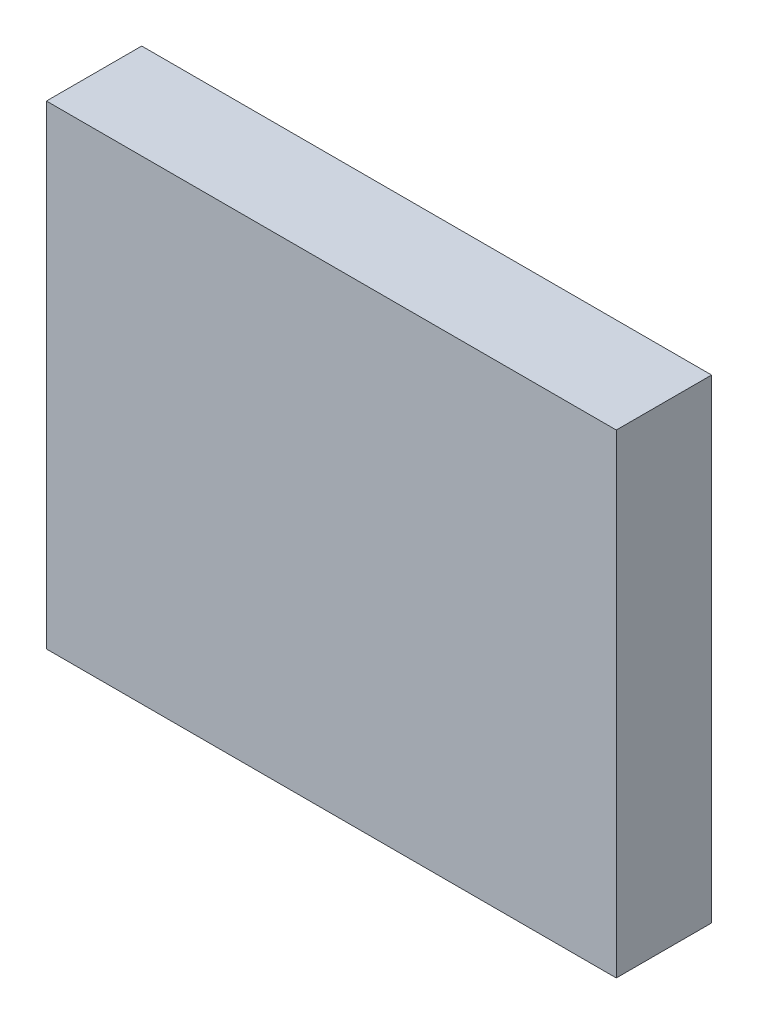
ISO-10303-21;
HEADER;
FILE_DESCRIPTION(('STEP AP214'),'2;1');
FILE_NAME('part.step','',(''),(''),'','','');
FILE_SCHEMA(('AUTOMOTIVE_DESIGN { 1 0 10303 214 1 1 1 1 }'));
ENDSEC;
DATA;
#1=APPLICATION_CONTEXT('core data for automotive mechanical design processes');
#2=APPLICATION_PROTOCOL_DEFINITION('international standard','automotive_design',2000,#1);
#3=PRODUCT_CONTEXT('',#1,'mechanical');
#4=PRODUCT('Part','Part','',(#3));
#5=PRODUCT_RELATED_PRODUCT_CATEGORY('part','',(#4));
#6=PRODUCT_DEFINITION_FORMATION('','',#4);
#7=PRODUCT_DEFINITION_CONTEXT('part definition',#1,'design');
#8=PRODUCT_DEFINITION('design','',#6,#7);
#9=PRODUCT_DEFINITION_SHAPE('','',#8);
#10=(LENGTH_UNIT() NAMED_UNIT(*) SI_UNIT(.MILLI.,.METRE.));
#11=(NAMED_UNIT(*) PLANE_ANGLE_UNIT() SI_UNIT($,.RADIAN.));
#12=(NAMED_UNIT(*) SI_UNIT($,.STERADIAN.) SOLID_ANGLE_UNIT());
#13=UNCERTAINTY_MEASURE_WITH_UNIT(LENGTH_MEASURE(1.E-05),#10,'distance_accuracy_value','');
#14=(GEOMETRIC_REPRESENTATION_CONTEXT(3) GLOBAL_UNCERTAINTY_ASSIGNED_CONTEXT((#13)) GLOBAL_UNIT_ASSIGNED_CONTEXT((#10,
#11,#12)) REPRESENTATION_CONTEXT('',''));
#15=CARTESIAN_POINT('',(0.,0.,0.));
#16=DIRECTION('',(0.,0.,1.));
#17=DIRECTION('',(1.,0.,0.));
#18=AXIS2_PLACEMENT_3D('',#15,#16,#17);
#19=CARTESIAN_POINT('',(-1.003,-0.627,0.));
#20=DIRECTION('',(0.,-1.,0.));
#21=DIRECTION('',(0.,0.,1.));
#22=AXIS2_PLACEMENT_3D('',#19,#20,#21);
#23=PLANE('',#22);
#24=DIRECTION('',(-1.,0.,0.));
#25=VECTOR('',#24,1.);
#26=CARTESIAN_POINT('',(-0.698,-0.627,0.));
#27=LINE('',#26,#25);
#28=CARTESIAN_POINT('',(-0.698,-0.627,0.));
#29=VERTEX_POINT('',#28);
#30=CARTESIAN_POINT('',(-1.003,-0.627,0.));
#31=VERTEX_POINT('',#30);
#32=EDGE_CURVE('E11',#29,#31,#27,.T.);
#33=ORIENTED_EDGE('',*,*,#32,.F.);
#34=DIRECTION('',(0.,0.,-1.));
#35=VECTOR('',#34,1.);
#36=CARTESIAN_POINT('',(-0.698,-0.627,0.051));
#37=LINE('',#36,#35);
#38=CARTESIAN_POINT('',(-0.698,-0.627,0.051));
#39=VERTEX_POINT('',#38);
#40=EDGE_CURVE('E24',#39,#29,#37,.T.);
#41=ORIENTED_EDGE('',*,*,#40,.F.);
#42=DIRECTION('',(1.,0.,0.));
#43=VECTOR('',#42,1.);
#44=CARTESIAN_POINT('',(-1.003,-0.627,0.051));
#45=LINE('',#44,#43);
#46=CARTESIAN_POINT('',(-1.003,-0.627,0.051));
#47=VERTEX_POINT('',#46);
#48=EDGE_CURVE('E88',#47,#39,#45,.T.);
#49=ORIENTED_EDGE('',*,*,#48,.F.);
#50=DIRECTION('',(0.,0.,1.));
#51=VECTOR('',#50,1.);
#52=CARTESIAN_POINT('',(-1.003,-0.627,0.));
#53=LINE('',#52,#51);
#54=EDGE_CURVE('E77',#31,#47,#53,.T.);
#55=ORIENTED_EDGE('',*,*,#54,.F.);
#56=EDGE_LOOP('',(#33,#41,#49,#55));
#57=FACE_BOUND('',#56,.T.);
#58=ADVANCED_FACE('F17',(#57),#23,.T.);
#59=CARTESIAN_POINT('',(-0.698,-0.627,0.));
#60=DIRECTION('',(1.,0.,0.));
#61=DIRECTION('',(0.,0.,1.));
#62=AXIS2_PLACEMENT_3D('',#59,#60,#61);
#63=PLANE('',#62);
#64=DIRECTION('',(0.,-1.,0.));
#65=VECTOR('',#64,1.);
#66=CARTESIAN_POINT('',(-0.698,-0.373,0.));
#67=LINE('',#66,#65);
#68=CARTESIAN_POINT('',(-0.698,-0.373,0.));
#69=VERTEX_POINT('',#68);
#70=EDGE_CURVE('E85',#69,#29,#67,.T.);
#71=ORIENTED_EDGE('',*,*,#70,.F.);
#72=DIRECTION('',(0.,0.,-1.));
#73=VECTOR('',#72,1.);
#74=CARTESIAN_POINT('',(-0.698,-0.373,0.051));
#75=LINE('',#74,#73);
#76=CARTESIAN_POINT('',(-0.698,-0.373,0.051));
#77=VERTEX_POINT('',#76);
#78=EDGE_CURVE('E83',#77,#69,#75,.T.);
#79=ORIENTED_EDGE('',*,*,#78,.F.);
#80=DIRECTION('',(0.,1.,0.));
#81=VECTOR('',#80,1.);
#82=CARTESIAN_POINT('',(-0.698,-0.627,0.051));
#83=LINE('',#82,#81);
#84=EDGE_CURVE('E72',#39,#77,#83,.T.);
#85=ORIENTED_EDGE('',*,*,#84,.F.);
#86=ORIENTED_EDGE('',*,*,#40,.T.);
#87=EDGE_LOOP('',(#71,#79,#85,#86));
#88=FACE_BOUND('',#87,.T.);
#89=ADVANCED_FACE('F90',(#88),#63,.T.);
#90=CARTESIAN_POINT('',(-0.698,-0.373,0.));
#91=DIRECTION('',(0.,1.,0.));
#92=DIRECTION('',(0.,0.,1.));
#93=AXIS2_PLACEMENT_3D('',#90,#91,#92);
#94=PLANE('',#93);
#95=DIRECTION('',(1.,0.,0.));
#96=VECTOR('',#95,1.);
#97=CARTESIAN_POINT('',(-1.003,-0.373,0.));
#98=LINE('',#97,#96);
#99=CARTESIAN_POINT('',(-1.003,-0.373,0.));
#100=VERTEX_POINT('',#99);
#101=EDGE_CURVE('E60',#100,#69,#98,.T.);
#102=ORIENTED_EDGE('',*,*,#101,.F.);
#103=DIRECTION('',(0.,0.,-1.));
#104=VECTOR('',#103,1.);
#105=CARTESIAN_POINT('',(-1.003,-0.373,0.051));
#106=LINE('',#105,#104);
#107=CARTESIAN_POINT('',(-1.003,-0.373,0.051));
#108=VERTEX_POINT('',#107);
#109=EDGE_CURVE('E54',#108,#100,#106,.T.);
#110=ORIENTED_EDGE('',*,*,#109,.F.);
#111=DIRECTION('',(-1.,0.,0.));
#112=VECTOR('',#111,1.);
#113=CARTESIAN_POINT('',(-0.698,-0.373,0.051));
#114=LINE('',#113,#112);
#115=EDGE_CURVE('E58',#77,#108,#114,.T.);
#116=ORIENTED_EDGE('',*,*,#115,.F.);
#117=ORIENTED_EDGE('',*,*,#78,.T.);
#118=EDGE_LOOP('',(#102,#110,#116,#117));
#119=FACE_BOUND('',#118,.T.);
#120=ADVANCED_FACE('F56',(#119),#94,.T.);
#121=CARTESIAN_POINT('',(-1.003,-0.373,0.));
#122=DIRECTION('',(-1.,0.,0.));
#123=DIRECTION('',(0.,0.,1.));
#124=AXIS2_PLACEMENT_3D('',#121,#122,#123);
#125=PLANE('',#124);
#126=DIRECTION('',(0.,1.,0.));
#127=VECTOR('',#126,1.);
#128=CARTESIAN_POINT('',(-1.003,-0.627,0.));
#129=LINE('',#128,#127);
#130=EDGE_CURVE('E73',#31,#100,#129,.T.);
#131=ORIENTED_EDGE('',*,*,#130,.F.);
#132=ORIENTED_EDGE('',*,*,#54,.T.);
#133=DIRECTION('',(0.,-1.,0.));
#134=VECTOR('',#133,1.);
#135=CARTESIAN_POINT('',(-1.003,-0.373,0.051));
#136=LINE('',#135,#134);
#137=EDGE_CURVE('E70',#108,#47,#136,.T.);
#138=ORIENTED_EDGE('',*,*,#137,.F.);
#139=ORIENTED_EDGE('',*,*,#109,.T.);
#140=EDGE_LOOP('',(#131,#132,#138,#139));
#141=FACE_BOUND('',#140,.T.);
#142=ADVANCED_FACE('F76',(#141),#125,.T.);
#143=CARTESIAN_POINT('',(-1.003,-0.373,0.));
#144=DIRECTION('',(0.,0.,-1.));
#145=DIRECTION('',(0.,1.,0.));
#146=AXIS2_PLACEMENT_3D('',#143,#144,#145);
#147=PLANE('',#146);
#148=ORIENTED_EDGE('',*,*,#101,.T.);
#149=ORIENTED_EDGE('',*,*,#70,.T.);
#150=ORIENTED_EDGE('',*,*,#32,.T.);
#151=ORIENTED_EDGE('',*,*,#130,.T.);
#152=EDGE_LOOP('',(#148,#149,#150,#151));
#153=FACE_BOUND('',#152,.T.);
#154=ADVANCED_FACE('F91',(#153),#147,.T.);
#155=CARTESIAN_POINT('',(-1.003,-0.627,0.051));
#156=DIRECTION('',(0.,0.,1.));
#157=DIRECTION('',(0.,1.,0.));
#158=AXIS2_PLACEMENT_3D('',#155,#156,#157);
#159=PLANE('',#158);
#160=ORIENTED_EDGE('',*,*,#48,.T.);
#161=ORIENTED_EDGE('',*,*,#84,.T.);
#162=ORIENTED_EDGE('',*,*,#115,.T.);
#163=ORIENTED_EDGE('',*,*,#137,.T.);
#164=EDGE_LOOP('',(#160,#161,#162,#163));
#165=FACE_BOUND('',#164,.T.);
#166=ADVANCED_FACE('F69',(#165),#159,.T.);
#167=CLOSED_SHELL('',(#58,#89,#120,#142,#154,#166));
#168=MANIFOLD_SOLID_BREP('B1',#167);
#169=ADVANCED_BREP_SHAPE_REPRESENTATION('',(#18,#168),#14);
#170=SHAPE_DEFINITION_REPRESENTATION(#9,#169);
ENDSEC;
END-ISO-10303-21;
